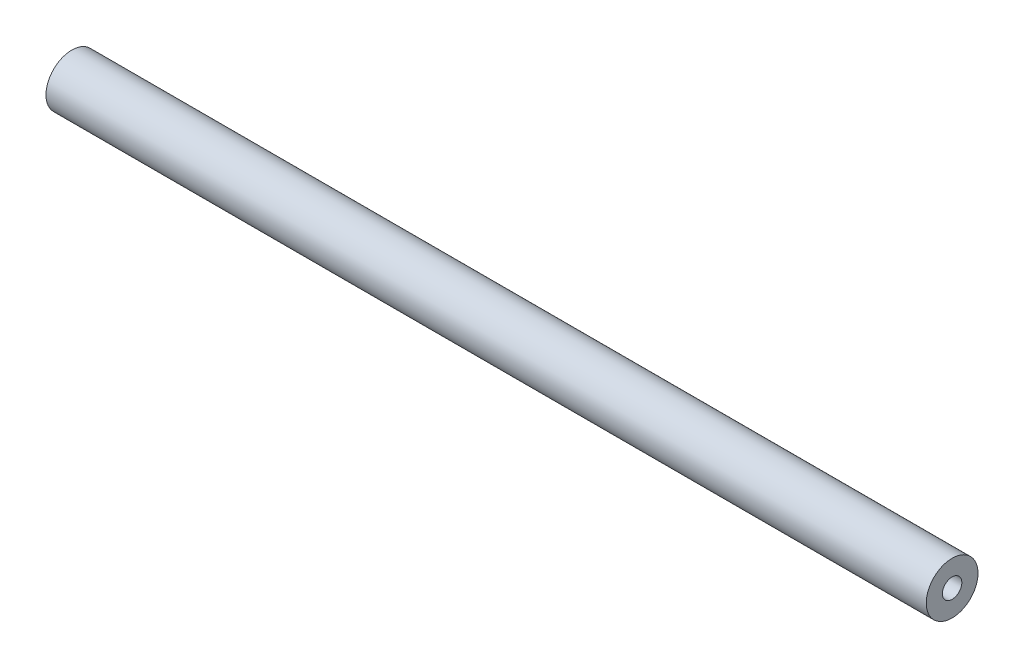
ISO-10303-21;
HEADER;
FILE_DESCRIPTION(('STEP AP214'),'2;1');
FILE_NAME('part.step','',(''),(''),'','','');
FILE_SCHEMA(('AUTOMOTIVE_DESIGN { 1 0 10303 214 1 1 1 1 }'));
ENDSEC;
DATA;
#1=APPLICATION_CONTEXT('core data for automotive mechanical design processes');
#2=APPLICATION_PROTOCOL_DEFINITION('international standard','automotive_design',2000,#1);
#3=PRODUCT_CONTEXT('',#1,'mechanical');
#4=PRODUCT('Part','Part','',(#3));
#5=PRODUCT_RELATED_PRODUCT_CATEGORY('part','',(#4));
#6=PRODUCT_DEFINITION_FORMATION('','',#4);
#7=PRODUCT_DEFINITION_CONTEXT('part definition',#1,'design');
#8=PRODUCT_DEFINITION('design','',#6,#7);
#9=PRODUCT_DEFINITION_SHAPE('','',#8);
#10=(LENGTH_UNIT() NAMED_UNIT(*) SI_UNIT(.MILLI.,.METRE.));
#11=(NAMED_UNIT(*) PLANE_ANGLE_UNIT() SI_UNIT($,.RADIAN.));
#12=(NAMED_UNIT(*) SI_UNIT($,.STERADIAN.) SOLID_ANGLE_UNIT());
#13=UNCERTAINTY_MEASURE_WITH_UNIT(LENGTH_MEASURE(1.E-05),#10,'distance_accuracy_value','');
#14=(GEOMETRIC_REPRESENTATION_CONTEXT(3) GLOBAL_UNCERTAINTY_ASSIGNED_CONTEXT((#13)) GLOBAL_UNIT_ASSIGNED_CONTEXT((#10,
#11,#12)) REPRESENTATION_CONTEXT('',''));
#15=CARTESIAN_POINT('',(0.,0.,0.));
#16=DIRECTION('',(0.,0.,1.));
#17=DIRECTION('',(1.,0.,0.));
#18=AXIS2_PLACEMENT_3D('',#15,#16,#17);
#19=CARTESIAN_POINT('',(0.,0.,8.));
#20=DIRECTION('',(1.,0.,0.));
#21=DIRECTION('',(0.,1.,0.));
#22=AXIS2_PLACEMENT_3D('',#19,#20,#21);
#23=PLANE('',#22);
#24=CARTESIAN_POINT('',(0.,-4.,4.));
#25=DIRECTION('',(-1.,0.,0.));
#26=DIRECTION('',(0.,-1.,0.));
#27=AXIS2_PLACEMENT_3D('',#24,#25,#26);
#28=CIRCLE('',#27,1.5);
#29=CARTESIAN_POINT('',(0.,-5.5,4.));
#30=VERTEX_POINT('',#29);
#31=EDGE_CURVE('E39',#30,#30,#28,.T.);
#32=ORIENTED_EDGE('',*,*,#31,.F.);
#33=EDGE_LOOP('',(#32));
#34=FACE_BOUND('',#33,.T.);
#35=CARTESIAN_POINT('',(0.,-3.99999999999998,4.));
#36=DIRECTION('',(1.,0.,0.));
#37=DIRECTION('',(0.,0.,-1.));
#38=AXIS2_PLACEMENT_3D('',#35,#36,#37);
#39=CIRCLE('',#38,4.);
#40=CARTESIAN_POINT('',(0.,-3.99999999999998,0.));
#41=VERTEX_POINT('',#40);
#42=EDGE_CURVE('E51',#41,#41,#39,.T.);
#43=ORIENTED_EDGE('',*,*,#42,.F.);
#44=EDGE_LOOP('',(#43));
#45=FACE_BOUND('',#44,.T.);
#46=ADVANCED_FACE('F36',(#34,#45),#23,.F.);
#47=CARTESIAN_POINT('',(10.,-4.,4.));
#48=DIRECTION('',(-1.,0.,0.));
#49=DIRECTION('',(0.,-1.,0.));
#50=AXIS2_PLACEMENT_3D('',#47,#48,#49);
#51=CYLINDRICAL_SURFACE('',#50,1.5);
#52=CARTESIAN_POINT('',(10.,-4.,4.));
#53=DIRECTION('',(-1.,0.,0.));
#54=DIRECTION('',(0.,-1.,0.));
#55=AXIS2_PLACEMENT_3D('',#52,#53,#54);
#56=CIRCLE('',#55,1.5);
#57=CARTESIAN_POINT('',(10.,-5.5,4.));
#58=VERTEX_POINT('',#57);
#59=EDGE_CURVE('E10',#58,#58,#56,.T.);
#60=ORIENTED_EDGE('',*,*,#59,.F.);
#61=EDGE_LOOP('',(#60));
#62=FACE_BOUND('',#61,.T.);
#63=ORIENTED_EDGE('',*,*,#31,.T.);
#64=EDGE_LOOP('',(#63));
#65=FACE_BOUND('',#64,.T.);
#66=ADVANCED_FACE('F63',(#62,#65),#51,.F.);
#67=CARTESIAN_POINT('',(10.,-4.,4.));
#68=DIRECTION('',(-1.,0.,0.));
#69=DIRECTION('',(0.,-1.,0.));
#70=AXIS2_PLACEMENT_3D('',#67,#68,#69);
#71=PLANE('',#70);
#72=ORIENTED_EDGE('',*,*,#59,.T.);
#73=EDGE_LOOP('',(#72));
#74=FACE_BOUND('',#73,.T.);
#75=ADVANCED_FACE('F68',(#74),#71,.T.);
#76=CARTESIAN_POINT('',(0.,-3.99999999999998,4.));
#77=DIRECTION('',(1.,0.,0.));
#78=DIRECTION('',(0.,0.,-1.));
#79=AXIS2_PLACEMENT_3D('',#76,#77,#78);
#80=CYLINDRICAL_SURFACE('',#79,4.);
#81=CARTESIAN_POINT('',(136.,-3.99999999999998,4.));
#82=DIRECTION('',(1.,0.,0.));
#83=DIRECTION('',(0.,0.,-1.));
#84=AXIS2_PLACEMENT_3D('',#81,#82,#83);
#85=CIRCLE('',#84,4.);
#86=CARTESIAN_POINT('',(136.,-3.99999999999998,0.));
#87=VERTEX_POINT('',#86);
#88=EDGE_CURVE('E54',#87,#87,#85,.T.);
#89=ORIENTED_EDGE('',*,*,#88,.F.);
#90=EDGE_LOOP('',(#89));
#91=FACE_BOUND('',#90,.T.);
#92=ORIENTED_EDGE('',*,*,#42,.T.);
#93=EDGE_LOOP('',(#92));
#94=FACE_BOUND('',#93,.T.);
#95=ADVANCED_FACE('F60',(#91,#94),#80,.T.);
#96=CARTESIAN_POINT('',(126.,-3.99999999999998,4.));
#97=DIRECTION('',(-1.,0.,0.));
#98=DIRECTION('',(0.,-1.,0.));
#99=AXIS2_PLACEMENT_3D('',#96,#97,#98);
#100=PLANE('',#99);
#101=CARTESIAN_POINT('',(126.,-3.99999999999998,4.));
#102=DIRECTION('',(-1.,0.,0.));
#103=DIRECTION('',(0.,-1.,0.));
#104=AXIS2_PLACEMENT_3D('',#101,#102,#103);
#105=CIRCLE('',#104,1.5);
#106=CARTESIAN_POINT('',(126.,-5.49999999999998,4.));
#107=VERTEX_POINT('',#106);
#108=EDGE_CURVE('E46',#107,#107,#105,.T.);
#109=ORIENTED_EDGE('',*,*,#108,.F.);
#110=EDGE_LOOP('',(#109));
#111=FACE_BOUND('',#110,.T.);
#112=ADVANCED_FACE('F85',(#111),#100,.F.);
#113=CARTESIAN_POINT('',(126.,-3.99999999999998,4.));
#114=DIRECTION('',(1.,0.,0.));
#115=DIRECTION('',(0.,1.,0.));
#116=AXIS2_PLACEMENT_3D('',#113,#114,#115);
#117=CYLINDRICAL_SURFACE('',#116,1.5);
#118=ORIENTED_EDGE('',*,*,#108,.T.);
#119=EDGE_LOOP('',(#118));
#120=FACE_BOUND('',#119,.T.);
#121=CARTESIAN_POINT('',(136.,-3.99999999999998,4.));
#122=DIRECTION('',(-1.,0.,0.));
#123=DIRECTION('',(0.,-1.,0.));
#124=AXIS2_PLACEMENT_3D('',#121,#122,#123);
#125=CIRCLE('',#124,1.5);
#126=CARTESIAN_POINT('',(136.,-5.49999999999998,4.));
#127=VERTEX_POINT('',#126);
#128=EDGE_CURVE('E48',#127,#127,#125,.T.);
#129=ORIENTED_EDGE('',*,*,#128,.F.);
#130=EDGE_LOOP('',(#129));
#131=FACE_BOUND('',#130,.T.);
#132=ADVANCED_FACE('F80',(#120,#131),#117,.F.);
#133=CARTESIAN_POINT('',(136.,0.,8.));
#134=DIRECTION('',(-1.,0.,0.));
#135=DIRECTION('',(0.,0.,1.));
#136=AXIS2_PLACEMENT_3D('',#133,#134,#135);
#137=PLANE('',#136);
#138=ORIENTED_EDGE('',*,*,#128,.T.);
#139=EDGE_LOOP('',(#138));
#140=FACE_BOUND('',#139,.T.);
#141=ORIENTED_EDGE('',*,*,#88,.T.);
#142=EDGE_LOOP('',(#141));
#143=FACE_BOUND('',#142,.T.);
#144=ADVANCED_FACE('F78',(#140,#143),#137,.F.);
#145=CLOSED_SHELL('',(#46,#66,#75,#95,#112,#132,#144));
#146=MANIFOLD_SOLID_BREP('B2',#145);
#147=ADVANCED_BREP_SHAPE_REPRESENTATION('',(#18,#146),#14);
#148=SHAPE_DEFINITION_REPRESENTATION(#9,#147);
ENDSEC;
END-ISO-10303-21;
